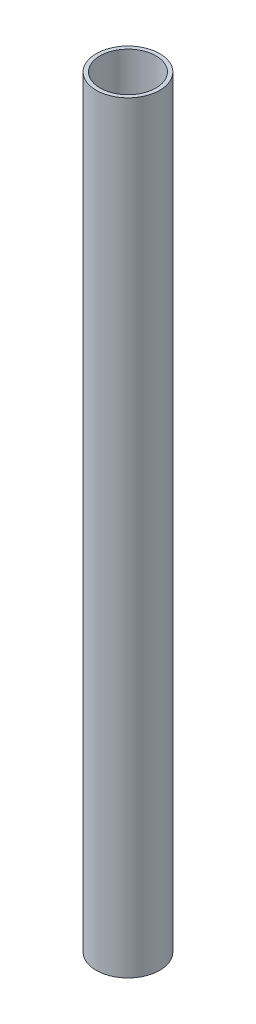
ISO-10303-21;
HEADER;
FILE_DESCRIPTION(('STEP AP214'),'2;1');
FILE_NAME('part.step','',(''),(''),'','','');
FILE_SCHEMA(('AUTOMOTIVE_DESIGN { 1 0 10303 214 1 1 1 1 }'));
ENDSEC;
DATA;
#1=APPLICATION_CONTEXT('core data for automotive mechanical design processes');
#2=APPLICATION_PROTOCOL_DEFINITION('international standard','automotive_design',2000,#1);
#3=PRODUCT_CONTEXT('',#1,'mechanical');
#4=PRODUCT('Part','Part','',(#3));
#5=PRODUCT_RELATED_PRODUCT_CATEGORY('part','',(#4));
#6=PRODUCT_DEFINITION_FORMATION('','',#4);
#7=PRODUCT_DEFINITION_CONTEXT('part definition',#1,'design');
#8=PRODUCT_DEFINITION('design','',#6,#7);
#9=PRODUCT_DEFINITION_SHAPE('','',#8);
#10=(LENGTH_UNIT() NAMED_UNIT(*) SI_UNIT(.MILLI.,.METRE.));
#11=(NAMED_UNIT(*) PLANE_ANGLE_UNIT() SI_UNIT($,.RADIAN.));
#12=(NAMED_UNIT(*) SI_UNIT($,.STERADIAN.) SOLID_ANGLE_UNIT());
#13=UNCERTAINTY_MEASURE_WITH_UNIT(LENGTH_MEASURE(1.E-05),#10,'distance_accuracy_value','');
#14=(GEOMETRIC_REPRESENTATION_CONTEXT(3) GLOBAL_UNCERTAINTY_ASSIGNED_CONTEXT((#13)) GLOBAL_UNIT_ASSIGNED_CONTEXT((#10,
#11,#12)) REPRESENTATION_CONTEXT('',''));
#15=CARTESIAN_POINT('',(0.,0.,0.));
#16=DIRECTION('',(0.,0.,1.));
#17=DIRECTION('',(1.,0.,0.));
#18=AXIS2_PLACEMENT_3D('',#15,#16,#17);
#19=CARTESIAN_POINT('',(0.,304.8,0.));
#20=DIRECTION('',(0.,1.,0.));
#21=DIRECTION('',(0.,0.,1.));
#22=AXIS2_PLACEMENT_3D('',#19,#20,#21);
#23=PLANE('',#22);
#24=CARTESIAN_POINT('',(0.,304.8,0.));
#25=DIRECTION('',(0.,1.,0.));
#26=DIRECTION('',(0.,0.,1.));
#27=AXIS2_PLACEMENT_3D('',#24,#25,#26);
#28=CIRCLE('',#27,12.7);
#29=CARTESIAN_POINT('',(0.,304.8,12.7));
#30=VERTEX_POINT('',#29);
#31=EDGE_CURVE('E10',#30,#30,#28,.T.);
#32=ORIENTED_EDGE('',*,*,#31,.T.);
#33=EDGE_LOOP('',(#32));
#34=FACE_BOUND('',#33,.T.);
#35=CARTESIAN_POINT('',(0.,304.8,0.));
#36=DIRECTION('',(0.,1.,0.));
#37=DIRECTION('',(0.,0.,1.));
#38=AXIS2_PLACEMENT_3D('',#35,#36,#37);
#39=CIRCLE('',#38,11.176);
#40=CARTESIAN_POINT('',(0.,304.8,11.176));
#41=VERTEX_POINT('',#40);
#42=EDGE_CURVE('E42',#41,#41,#39,.T.);
#43=ORIENTED_EDGE('',*,*,#42,.F.);
#44=EDGE_LOOP('',(#43));
#45=FACE_BOUND('',#44,.T.);
#46=ADVANCED_FACE('F31',(#34,#45),#23,.T.);
#47=CARTESIAN_POINT('',(0.,0.,0.));
#48=DIRECTION('',(0.,1.,0.));
#49=DIRECTION('',(0.,0.,1.));
#50=AXIS2_PLACEMENT_3D('',#47,#48,#49);
#51=PLANE('',#50);
#52=CARTESIAN_POINT('',(0.,0.,0.));
#53=DIRECTION('',(0.,1.,0.));
#54=DIRECTION('',(0.,0.,1.));
#55=AXIS2_PLACEMENT_3D('',#52,#53,#54);
#56=CIRCLE('',#55,12.7);
#57=CARTESIAN_POINT('',(0.,0.,12.7));
#58=VERTEX_POINT('',#57);
#59=EDGE_CURVE('E35',#58,#58,#56,.T.);
#60=ORIENTED_EDGE('',*,*,#59,.F.);
#61=EDGE_LOOP('',(#60));
#62=FACE_BOUND('',#61,.T.);
#63=CARTESIAN_POINT('',(0.,0.,0.));
#64=DIRECTION('',(0.,1.,0.));
#65=DIRECTION('',(0.,0.,1.));
#66=AXIS2_PLACEMENT_3D('',#63,#64,#65);
#67=CIRCLE('',#66,11.176);
#68=CARTESIAN_POINT('',(0.,0.,11.176));
#69=VERTEX_POINT('',#68);
#70=EDGE_CURVE('E44',#69,#69,#67,.T.);
#71=ORIENTED_EDGE('',*,*,#70,.T.);
#72=EDGE_LOOP('',(#71));
#73=FACE_BOUND('',#72,.T.);
#74=ADVANCED_FACE('F54',(#62,#73),#51,.F.);
#75=CARTESIAN_POINT('',(0.,304.8,0.));
#76=DIRECTION('',(0.,-1.,0.));
#77=DIRECTION('',(0.,0.,-1.));
#78=AXIS2_PLACEMENT_3D('',#75,#76,#77);
#79=CYLINDRICAL_SURFACE('',#78,12.7);
#80=ORIENTED_EDGE('',*,*,#31,.F.);
#81=EDGE_LOOP('',(#80));
#82=FACE_BOUND('',#81,.T.);
#83=ORIENTED_EDGE('',*,*,#59,.T.);
#84=EDGE_LOOP('',(#83));
#85=FACE_BOUND('',#84,.T.);
#86=ADVANCED_FACE('F33',(#82,#85),#79,.T.);
#87=CARTESIAN_POINT('',(0.,304.8,0.));
#88=DIRECTION('',(0.,-1.,0.));
#89=DIRECTION('',(0.,0.,-1.));
#90=AXIS2_PLACEMENT_3D('',#87,#88,#89);
#91=CYLINDRICAL_SURFACE('',#90,11.176);
#92=ORIENTED_EDGE('',*,*,#42,.T.);
#93=EDGE_LOOP('',(#92));
#94=FACE_BOUND('',#93,.T.);
#95=ORIENTED_EDGE('',*,*,#70,.F.);
#96=EDGE_LOOP('',(#95));
#97=FACE_BOUND('',#96,.T.);
#98=ADVANCED_FACE('F50',(#94,#97),#91,.F.);
#99=CLOSED_SHELL('',(#46,#74,#86,#98));
#100=MANIFOLD_SOLID_BREP('B2',#99);
#101=ADVANCED_BREP_SHAPE_REPRESENTATION('',(#18,#100),#14);
#102=SHAPE_DEFINITION_REPRESENTATION(#9,#101);
ENDSEC;
END-ISO-10303-21;
